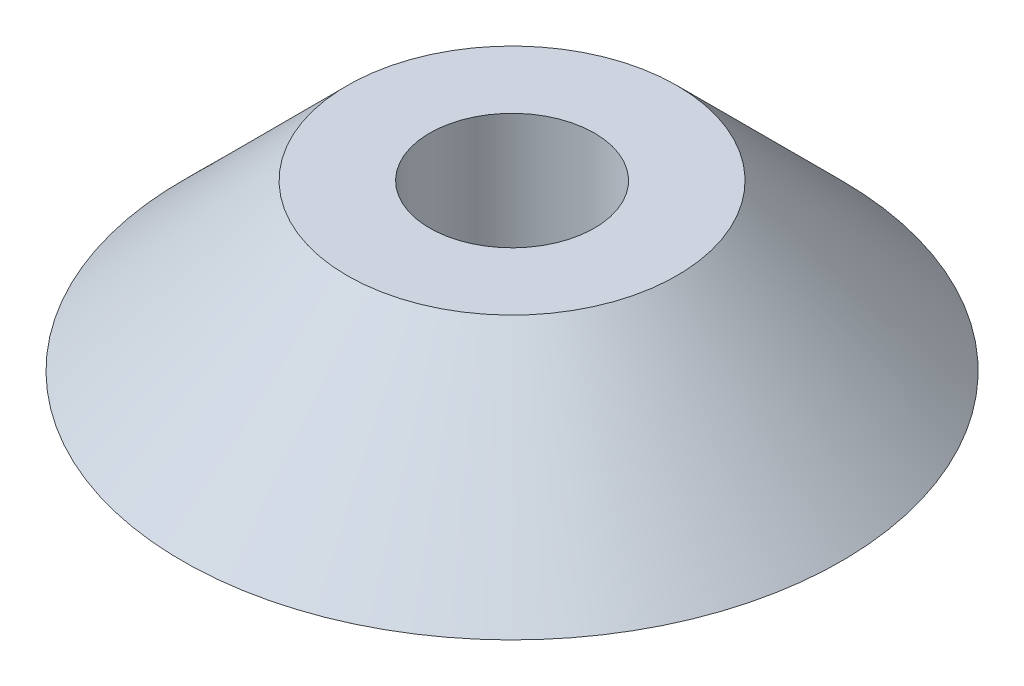
ISO-10303-21;
HEADER;
FILE_DESCRIPTION(('STEP AP214'),'2;1');
FILE_NAME('part.step','',(''),(''),'','','');
FILE_SCHEMA(('AUTOMOTIVE_DESIGN { 1 0 10303 214 1 1 1 1 }'));
ENDSEC;
DATA;
#1=APPLICATION_CONTEXT('core data for automotive mechanical design processes');
#2=APPLICATION_PROTOCOL_DEFINITION('international standard','automotive_design',2000,#1);
#3=PRODUCT_CONTEXT('',#1,'mechanical');
#4=PRODUCT('Part','Part','',(#3));
#5=PRODUCT_RELATED_PRODUCT_CATEGORY('part','',(#4));
#6=PRODUCT_DEFINITION_FORMATION('','',#4);
#7=PRODUCT_DEFINITION_CONTEXT('part definition',#1,'design');
#8=PRODUCT_DEFINITION('design','',#6,#7);
#9=PRODUCT_DEFINITION_SHAPE('','',#8);
#10=(LENGTH_UNIT() NAMED_UNIT(*) SI_UNIT(.MILLI.,.METRE.));
#11=(NAMED_UNIT(*) PLANE_ANGLE_UNIT() SI_UNIT($,.RADIAN.));
#12=(NAMED_UNIT(*) SI_UNIT($,.STERADIAN.) SOLID_ANGLE_UNIT());
#13=UNCERTAINTY_MEASURE_WITH_UNIT(LENGTH_MEASURE(1.E-05),#10,'distance_accuracy_value','');
#14=(GEOMETRIC_REPRESENTATION_CONTEXT(3) GLOBAL_UNCERTAINTY_ASSIGNED_CONTEXT((#13)) GLOBAL_UNIT_ASSIGNED_CONTEXT((#10,
#11,#12)) REPRESENTATION_CONTEXT('',''));
#15=CARTESIAN_POINT('',(0.,0.,0.));
#16=DIRECTION('',(0.,0.,1.));
#17=DIRECTION('',(1.,0.,0.));
#18=AXIS2_PLACEMENT_3D('',#15,#16,#17);
#19=CARTESIAN_POINT('',(0.,0.,0.));
#20=DIRECTION('',(0.,-1.,0.));
#21=DIRECTION('',(0.,0.,-1.));
#22=AXIS2_PLACEMENT_3D('',#19,#20,#21);
#23=CONICAL_SURFACE('',#22,25.4000000000001,0.785398163397454);
#24=CARTESIAN_POINT('',(0.,12.6999999999999,0.));
#25=DIRECTION('',(0.,-1.,0.));
#26=DIRECTION('',(0.,0.,-1.));
#27=AXIS2_PLACEMENT_3D('',#24,#25,#26);
#28=CIRCLE('',#27,12.7);
#29=CARTESIAN_POINT('',(0.,12.6999999999999,-12.7));
#30=VERTEX_POINT('',#29);
#31=EDGE_CURVE('E10',#30,#30,#28,.T.);
#32=ORIENTED_EDGE('',*,*,#31,.T.);
#33=EDGE_LOOP('',(#32));
#34=FACE_BOUND('',#33,.T.);
#35=CARTESIAN_POINT('',(0.,0.,0.));
#36=DIRECTION('',(0.,-1.,0.));
#37=DIRECTION('',(0.,0.,-1.));
#38=AXIS2_PLACEMENT_3D('',#35,#36,#37);
#39=CIRCLE('',#38,25.4000000000001);
#40=CARTESIAN_POINT('',(0.,0.,-25.4000000000001));
#41=VERTEX_POINT('',#40);
#42=EDGE_CURVE('E44',#41,#41,#39,.T.);
#43=ORIENTED_EDGE('',*,*,#42,.F.);
#44=EDGE_LOOP('',(#43));
#45=FACE_BOUND('',#44,.T.);
#46=ADVANCED_FACE('F30',(#34,#45),#23,.T.);
#47=CARTESIAN_POINT('',(12.7,12.7,0.));
#48=DIRECTION('',(0.,1.,0.));
#49=DIRECTION('',(0.,0.,1.));
#50=AXIS2_PLACEMENT_3D('',#47,#48,#49);
#51=PLANE('',#50);
#52=CARTESIAN_POINT('',(0.,12.6999999999999,0.));
#53=DIRECTION('',(0.,-1.,0.));
#54=DIRECTION('',(0.,0.,-1.));
#55=AXIS2_PLACEMENT_3D('',#52,#53,#54);
#56=CIRCLE('',#55,6.35);
#57=CARTESIAN_POINT('',(0.,12.6999999999999,-6.35));
#58=VERTEX_POINT('',#57);
#59=EDGE_CURVE('E36',#58,#58,#56,.T.);
#60=ORIENTED_EDGE('',*,*,#59,.T.);
#61=EDGE_LOOP('',(#60));
#62=FACE_BOUND('',#61,.T.);
#63=ORIENTED_EDGE('',*,*,#31,.F.);
#64=EDGE_LOOP('',(#63));
#65=FACE_BOUND('',#64,.T.);
#66=ADVANCED_FACE('F54',(#62,#65),#51,.T.);
#67=CARTESIAN_POINT('',(0.,-1000.69375591004,0.));
#68=DIRECTION('',(0.,-1.,0.));
#69=DIRECTION('',(0.,0.,-1.));
#70=AXIS2_PLACEMENT_3D('',#67,#68,#69);
#71=CYLINDRICAL_SURFACE('',#70,6.35);
#72=CARTESIAN_POINT('',(0.,0.,0.));
#73=DIRECTION('',(0.,-1.,0.));
#74=DIRECTION('',(0.,0.,-1.));
#75=AXIS2_PLACEMENT_3D('',#72,#73,#74);
#76=CIRCLE('',#75,6.35);
#77=CARTESIAN_POINT('',(0.,0.,-6.35));
#78=VERTEX_POINT('',#77);
#79=EDGE_CURVE('E40',#78,#78,#76,.T.);
#80=ORIENTED_EDGE('',*,*,#79,.T.);
#81=EDGE_LOOP('',(#80));
#82=FACE_BOUND('',#81,.T.);
#83=ORIENTED_EDGE('',*,*,#59,.F.);
#84=EDGE_LOOP('',(#83));
#85=FACE_BOUND('',#84,.T.);
#86=ADVANCED_FACE('F58',(#82,#85),#71,.F.);
#87=CARTESIAN_POINT('',(6.35,0.,0.));
#88=DIRECTION('',(0.,-1.,0.));
#89=DIRECTION('',(0.,0.,-1.));
#90=AXIS2_PLACEMENT_3D('',#87,#88,#89);
#91=PLANE('',#90);
#92=ORIENTED_EDGE('',*,*,#42,.T.);
#93=EDGE_LOOP('',(#92));
#94=FACE_BOUND('',#93,.T.);
#95=ORIENTED_EDGE('',*,*,#79,.F.);
#96=EDGE_LOOP('',(#95));
#97=FACE_BOUND('',#96,.T.);
#98=ADVANCED_FACE('F50',(#94,#97),#91,.T.);
#99=CLOSED_SHELL('',(#46,#66,#86,#98));
#100=MANIFOLD_SOLID_BREP('B2',#99);
#101=ADVANCED_BREP_SHAPE_REPRESENTATION('',(#18,#100),#14);
#102=SHAPE_DEFINITION_REPRESENTATION(#9,#101);
ENDSEC;
END-ISO-10303-21;
